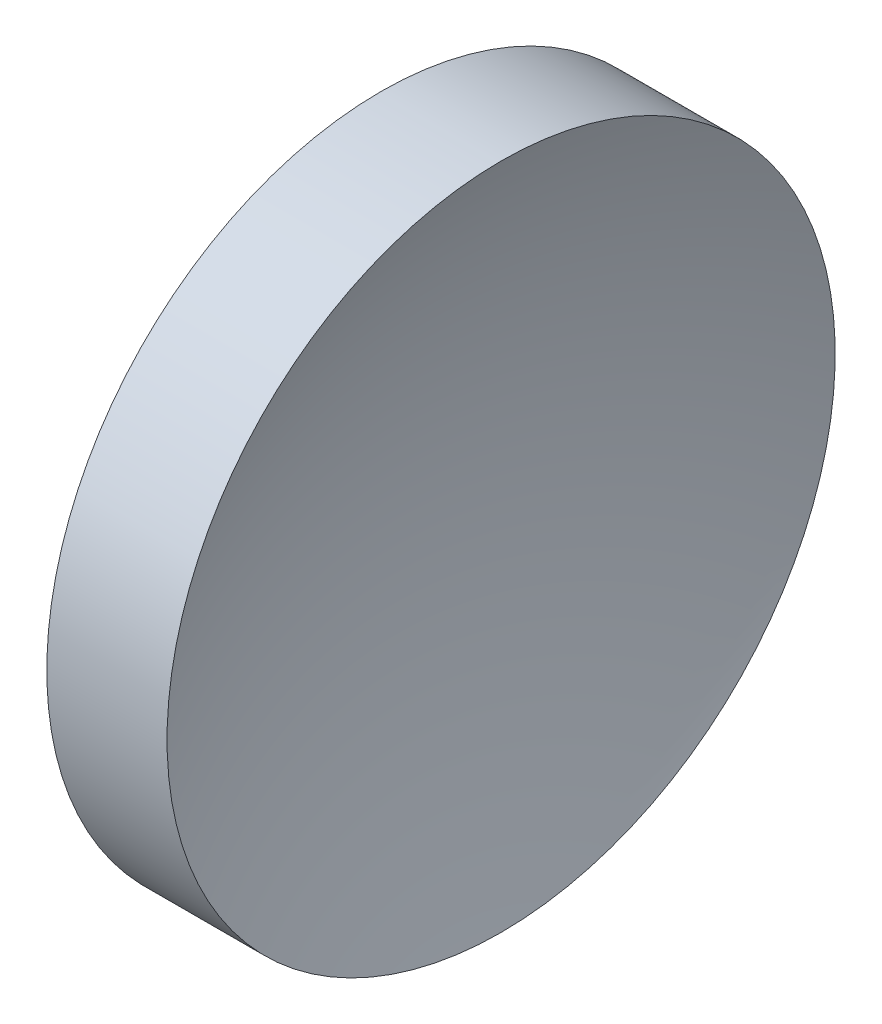
ISO-10303-21;
HEADER;
FILE_DESCRIPTION(('STEP AP214'),'2;1');
FILE_NAME('part.step','',(''),(''),'','','');
FILE_SCHEMA(('AUTOMOTIVE_DESIGN { 1 0 10303 214 1 1 1 1 }'));
ENDSEC;
DATA;
#1=APPLICATION_CONTEXT('core data for automotive mechanical design processes');
#2=APPLICATION_PROTOCOL_DEFINITION('international standard','automotive_design',2000,#1);
#3=PRODUCT_CONTEXT('',#1,'mechanical');
#4=PRODUCT('Part','Part','',(#3));
#5=PRODUCT_RELATED_PRODUCT_CATEGORY('part','',(#4));
#6=PRODUCT_DEFINITION_FORMATION('','',#4);
#7=PRODUCT_DEFINITION_CONTEXT('part definition',#1,'design');
#8=PRODUCT_DEFINITION('design','',#6,#7);
#9=PRODUCT_DEFINITION_SHAPE('','',#8);
#10=(LENGTH_UNIT() NAMED_UNIT(*) SI_UNIT(.MILLI.,.METRE.));
#11=(NAMED_UNIT(*) PLANE_ANGLE_UNIT() SI_UNIT($,.RADIAN.));
#12=(NAMED_UNIT(*) SI_UNIT($,.STERADIAN.) SOLID_ANGLE_UNIT());
#13=UNCERTAINTY_MEASURE_WITH_UNIT(LENGTH_MEASURE(1.E-05),#10,'distance_accuracy_value','');
#14=(GEOMETRIC_REPRESENTATION_CONTEXT(3) GLOBAL_UNCERTAINTY_ASSIGNED_CONTEXT((#13)) GLOBAL_UNIT_ASSIGNED_CONTEXT((#10,
#11,#12)) REPRESENTATION_CONTEXT('',''));
#15=CARTESIAN_POINT('',(0.,0.,0.));
#16=DIRECTION('',(0.,0.,1.));
#17=DIRECTION('',(1.,0.,0.));
#18=AXIS2_PLACEMENT_3D('',#15,#16,#17);
#19=CARTESIAN_POINT('',(91.8581901580211,32.5787747187973,0.));
#20=DIRECTION('',(0.,0.,-1.));
#21=DIRECTION('',(0.,-1.,0.));
#22=AXIS2_PLACEMENT_3D('',#19,#20,#21);
#23=CIRCLE('',#22,32.5);
#24=TRIMMED_CURVE('',#23,(PARAMETER_VALUE(-1.57079482508707)),
(PARAMETER_VALUE(1.57079482508707)),.T.,.PARAMETER.);
#25=CARTESIAN_POINT('',(91.8581901580211,32.5787259132931,0.));
#26=DIRECTION('',(-1.,0.,0.));
#27=AXIS1_PLACEMENT('',#25,#26);
#28=SURFACE_OF_REVOLUTION('',#24,#27);
#29=CARTESIAN_POINT('',(61.8582104936945,32.5787259132931,0.));
#30=DIRECTION('',(-1.,0.,0.));
#31=DIRECTION('',(0.,-1.,0.));
#32=AXIS2_PLACEMENT_3D('',#29,#30,#31);
#33=CIRCLE('',#32,12.5);
#34=CARTESIAN_POINT('',(61.8582104936945,20.0787259132931,0.));
#35=VERTEX_POINT('',#34);
#36=EDGE_CURVE('E11',#35,#35,#33,.T.);
#37=ORIENTED_EDGE('',*,*,#36,.F.);
#38=EDGE_LOOP('',(#37));
#39=FACE_BOUND('',#38,.T.);
#40=CARTESIAN_POINT('',(59.3581901580577,32.5787259132931,0.));
#41=VERTEX_POINT('',#40);
#42=VERTEX_LOOP('',#41);
#43=FACE_BOUND('',#42,.T.);
#44=ADVANCED_FACE('F37',(#39,#43),#28,.F.);
#45=CARTESIAN_POINT('',(55.0073946244212,32.5787259132931,0.));
#46=DIRECTION('',(-1.,0.,0.));
#47=DIRECTION('',(0.,-1.,0.));
#48=AXIS2_PLACEMENT_3D('',#45,#46,#47);
#49=CYLINDRICAL_SURFACE('',#48,12.5);
#50=CARTESIAN_POINT('',(57.3581901580211,32.5787259132931,0.));
#51=DIRECTION('',(-1.,0.,0.));
#52=DIRECTION('',(0.,-1.,0.));
#53=AXIS2_PLACEMENT_3D('',#50,#51,#52);
#54=CIRCLE('',#53,12.5);
#55=CARTESIAN_POINT('',(57.3581901580211,20.0787259132931,0.));
#56=VERTEX_POINT('',#55);
#57=EDGE_CURVE('E43',#56,#56,#54,.T.);
#58=ORIENTED_EDGE('',*,*,#57,.F.);
#59=EDGE_LOOP('',(#58));
#60=FACE_BOUND('',#59,.T.);
#61=ORIENTED_EDGE('',*,*,#36,.T.);
#62=EDGE_LOOP('',(#61));
#63=FACE_BOUND('',#62,.T.);
#64=ADVANCED_FACE('F47',(#60,#63),#49,.T.);
#65=CARTESIAN_POINT('',(57.3581901580211,32.5787259132931,0.));
#66=DIRECTION('',(1.,0.,0.));
#67=DIRECTION('',(0.,1.,0.));
#68=AXIS2_PLACEMENT_3D('',#65,#66,#67);
#69=PLANE('',#68);
#70=ORIENTED_EDGE('',*,*,#57,.T.);
#71=EDGE_LOOP('',(#70));
#72=FACE_BOUND('',#71,.T.);
#73=ADVANCED_FACE('F52',(#72),#69,.F.);
#74=CLOSED_SHELL('',(#44,#64,#73));
#75=MANIFOLD_SOLID_BREP('B2',#74);
#76=ADVANCED_BREP_SHAPE_REPRESENTATION('',(#18,#75),#14);
#77=SHAPE_DEFINITION_REPRESENTATION(#9,#76);
ENDSEC;
END-ISO-10303-21;
